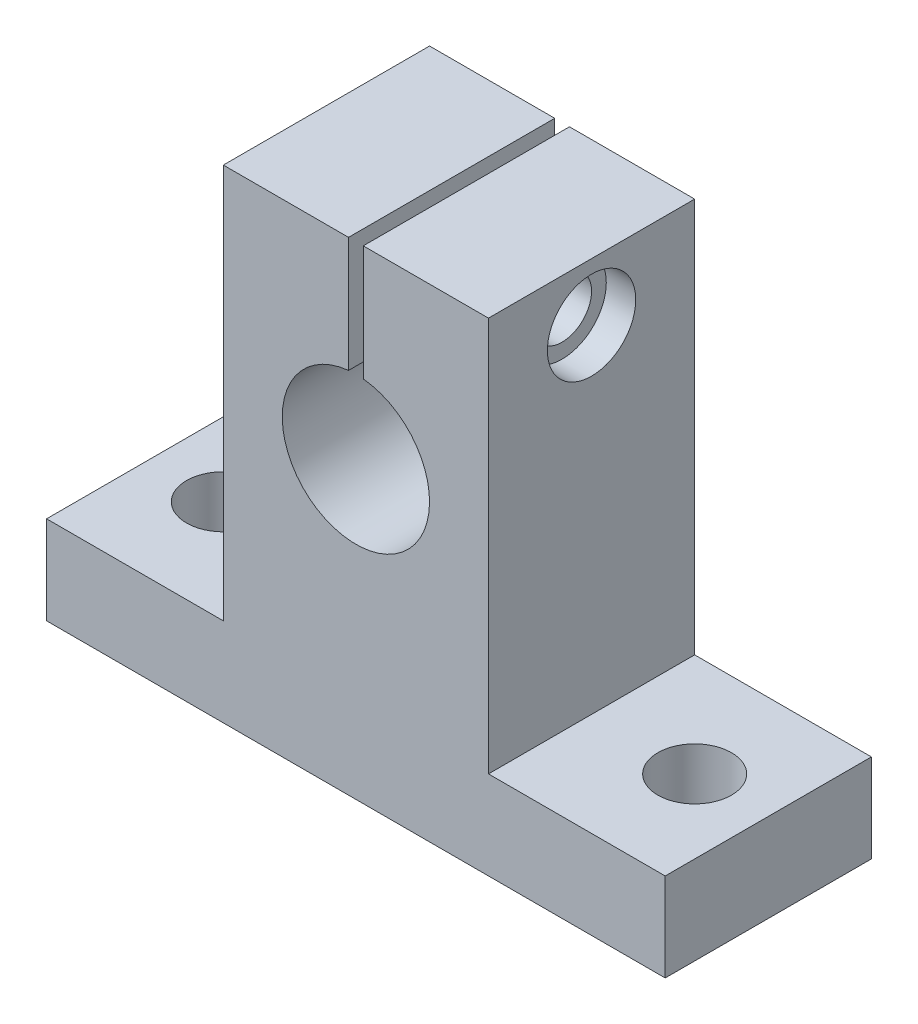
ISO-10303-21;
HEADER;
FILE_DESCRIPTION(('STEP AP214'),'2;1');
FILE_NAME('part.step','',(''),(''),'','','');
FILE_SCHEMA(('AUTOMOTIVE_DESIGN { 1 0 10303 214 1 1 1 1 }'));
ENDSEC;
DATA;
#1=APPLICATION_CONTEXT('core data for automotive mechanical design processes');
#2=APPLICATION_PROTOCOL_DEFINITION('international standard','automotive_design',2000,#1);
#3=PRODUCT_CONTEXT('',#1,'mechanical');
#4=PRODUCT('Part','Part','',(#3));
#5=PRODUCT_RELATED_PRODUCT_CATEGORY('part','',(#4));
#6=PRODUCT_DEFINITION_FORMATION('','',#4);
#7=PRODUCT_DEFINITION_CONTEXT('part definition',#1,'design');
#8=PRODUCT_DEFINITION('design','',#6,#7);
#9=PRODUCT_DEFINITION_SHAPE('','',#8);
#10=(LENGTH_UNIT() NAMED_UNIT(*) SI_UNIT(.MILLI.,.METRE.));
#11=(NAMED_UNIT(*) PLANE_ANGLE_UNIT() SI_UNIT($,.RADIAN.));
#12=(NAMED_UNIT(*) SI_UNIT($,.STERADIAN.) SOLID_ANGLE_UNIT());
#13=UNCERTAINTY_MEASURE_WITH_UNIT(LENGTH_MEASURE(1.E-05),#10,'distance_accuracy_value','');
#14=(GEOMETRIC_REPRESENTATION_CONTEXT(3) GLOBAL_UNCERTAINTY_ASSIGNED_CONTEXT((#13)) GLOBAL_UNIT_ASSIGNED_CONTEXT((#10,
#11,#12)) REPRESENTATION_CONTEXT('',''));
#15=CARTESIAN_POINT('',(0.,0.,0.));
#16=DIRECTION('',(0.,0.,1.));
#17=DIRECTION('',(1.,0.,0.));
#18=AXIS2_PLACEMENT_3D('',#15,#16,#17);
#19=CARTESIAN_POINT('',(-10.5,28.8874685927665,7.));
#20=DIRECTION('',(1.,0.,0.));
#21=DIRECTION('',(0.,0.,-1.));
#22=AXIS2_PLACEMENT_3D('',#19,#20,#21);
#23=CYLINDRICAL_SURFACE('',#22,2.);
#24=CARTESIAN_POINT('',(0.500000000000002,28.8874685927665,7.));
#25=DIRECTION('',(1.,0.,0.));
#26=DIRECTION('',(0.,0.,-1.));
#27=AXIS2_PLACEMENT_3D('',#24,#25,#26);
#28=CIRCLE('',#27,2.);
#29=CARTESIAN_POINT('',(0.500000000000002,28.8874685927665,5.));
#30=VERTEX_POINT('',#29);
#31=EDGE_CURVE('E203',#30,#30,#28,.T.);
#32=ORIENTED_EDGE('',*,*,#31,.F.);
#33=EDGE_LOOP('',(#32));
#34=FACE_BOUND('',#33,.T.);
#35=CARTESIAN_POINT('',(7.,28.8874685927665,7.));
#36=DIRECTION('',(1.,0.,0.));
#37=DIRECTION('',(0.,0.,-1.));
#38=AXIS2_PLACEMENT_3D('',#35,#36,#37);
#39=CIRCLE('',#38,2.);
#40=CARTESIAN_POINT('',(7.,28.8874685927665,5.));
#41=VERTEX_POINT('',#40);
#42=EDGE_CURVE('E39',#41,#41,#39,.F.);
#43=ORIENTED_EDGE('',*,*,#42,.F.);
#44=EDGE_LOOP('',(#43));
#45=FACE_BOUND('',#44,.T.);
#46=ADVANCED_FACE('F35',(#34,#45),#23,.F.);
#47=CARTESIAN_POINT('',(-9.,32.8,14.));
#48=DIRECTION('',(0.,-1.,0.));
#49=DIRECTION('',(0.,0.,-1.));
#50=AXIS2_PLACEMENT_3D('',#47,#48,#49);
#51=PLANE('',#50);
#52=DIRECTION('',(-1.,0.,0.));
#53=VECTOR('',#52,1.);
#54=CARTESIAN_POINT('',(-9.,32.8,14.));
#55=LINE('',#54,#53);
#56=CARTESIAN_POINT('',(-0.499999999999998,32.8,14.));
#57=VERTEX_POINT('',#56);
#58=CARTESIAN_POINT('',(-9.,32.8,14.));
#59=VERTEX_POINT('',#58);
#60=EDGE_CURVE('E136',#57,#59,#55,.T.);
#61=ORIENTED_EDGE('',*,*,#60,.F.);
#62=DIRECTION('',(0.,0.,1.));
#63=VECTOR('',#62,1.);
#64=CARTESIAN_POINT('',(-0.5,32.8,0.));
#65=LINE('',#64,#63);
#66=CARTESIAN_POINT('',(-0.5,32.8,0.));
#67=VERTEX_POINT('',#66);
#68=EDGE_CURVE('E123',#67,#57,#65,.T.);
#69=ORIENTED_EDGE('',*,*,#68,.F.);
#70=DIRECTION('',(-1.,0.,0.));
#71=VECTOR('',#70,1.);
#72=CARTESIAN_POINT('',(-9.,32.8,0.));
#73=LINE('',#72,#71);
#74=CARTESIAN_POINT('',(-9.,32.8,0.));
#75=VERTEX_POINT('',#74);
#76=EDGE_CURVE('E171',#67,#75,#73,.T.);
#77=ORIENTED_EDGE('',*,*,#76,.T.);
#78=DIRECTION('',(0.,0.,-1.));
#79=VECTOR('',#78,1.);
#80=CARTESIAN_POINT('',(-9.,32.8,14.));
#81=LINE('',#80,#79);
#82=EDGE_CURVE('E145',#59,#75,#81,.T.);
#83=ORIENTED_EDGE('',*,*,#82,.F.);
#84=EDGE_LOOP('',(#61,#69,#77,#83));
#85=FACE_BOUND('',#84,.T.);
#86=ADVANCED_FACE('F143',(#85),#51,.F.);
#87=CARTESIAN_POINT('',(0.,0.,14.));
#88=DIRECTION('',(0.,0.,-1.));
#89=DIRECTION('',(-1.,0.,0.));
#90=AXIS2_PLACEMENT_3D('',#87,#88,#89);
#91=PLANE('',#90);
#92=CARTESIAN_POINT('',(0.,20.,14.));
#93=DIRECTION('',(0.,0.,1.));
#94=DIRECTION('',(1.,0.,0.));
#95=AXIS2_PLACEMENT_3D('',#92,#93,#94);
#96=CIRCLE('',#95,5.);
#97=CARTESIAN_POINT('',(-0.499999999999998,24.9749371855331,14.));
#98=VERTEX_POINT('',#97);
#99=CARTESIAN_POINT('',(0.500000000000002,24.9749371855331,14.));
#100=VERTEX_POINT('',#99);
#101=EDGE_CURVE('E140',#98,#100,#96,.T.);
#102=ORIENTED_EDGE('',*,*,#101,.F.);
#103=DIRECTION('',(0.,1.,0.));
#104=VECTOR('',#103,1.);
#105=CARTESIAN_POINT('',(-0.499999999999998,18.8,14.));
#106=LINE('',#105,#104);
#107=EDGE_CURVE('E59',#98,#57,#106,.T.);
#108=ORIENTED_EDGE('',*,*,#107,.T.);
#109=ORIENTED_EDGE('',*,*,#60,.T.);
#110=DIRECTION('',(0.,-1.,0.));
#111=VECTOR('',#110,1.);
#112=CARTESIAN_POINT('',(-9.,6.,14.));
#113=LINE('',#112,#111);
#114=CARTESIAN_POINT('',(-9.,6.,14.));
#115=VERTEX_POINT('',#114);
#116=EDGE_CURVE('E151',#59,#115,#113,.T.);
#117=ORIENTED_EDGE('',*,*,#116,.T.);
#118=DIRECTION('',(-1.,0.,0.));
#119=VECTOR('',#118,1.);
#120=CARTESIAN_POINT('',(-21.,6.,14.));
#121=LINE('',#120,#119);
#122=CARTESIAN_POINT('',(-21.,6.,14.));
#123=VERTEX_POINT('',#122);
#124=EDGE_CURVE('E157',#115,#123,#121,.T.);
#125=ORIENTED_EDGE('',*,*,#124,.T.);
#126=DIRECTION('',(0.,-1.,0.));
#127=VECTOR('',#126,1.);
#128=CARTESIAN_POINT('',(-21.,0.,14.));
#129=LINE('',#128,#127);
#130=CARTESIAN_POINT('',(-21.,0.,14.));
#131=VERTEX_POINT('',#130);
#132=EDGE_CURVE('E179',#123,#131,#129,.T.);
#133=ORIENTED_EDGE('',*,*,#132,.T.);
#134=DIRECTION('',(1.,0.,0.));
#135=VECTOR('',#134,1.);
#136=CARTESIAN_POINT('',(21.,0.,14.));
#137=LINE('',#136,#135);
#138=CARTESIAN_POINT('',(21.,0.,14.));
#139=VERTEX_POINT('',#138);
#140=EDGE_CURVE('E244',#131,#139,#137,.T.);
#141=ORIENTED_EDGE('',*,*,#140,.T.);
#142=DIRECTION('',(0.,1.,0.));
#143=VECTOR('',#142,1.);
#144=CARTESIAN_POINT('',(21.,0.,14.));
#145=LINE('',#144,#143);
#146=CARTESIAN_POINT('',(21.,6.,14.));
#147=VERTEX_POINT('',#146);
#148=EDGE_CURVE('E246',#139,#147,#145,.T.);
#149=ORIENTED_EDGE('',*,*,#148,.T.);
#150=DIRECTION('',(-1.,0.,0.));
#151=VECTOR('',#150,1.);
#152=CARTESIAN_POINT('',(21.,6.,14.));
#153=LINE('',#152,#151);
#154=CARTESIAN_POINT('',(9.,6.,14.));
#155=VERTEX_POINT('',#154);
#156=EDGE_CURVE('E152',#147,#155,#153,.T.);
#157=ORIENTED_EDGE('',*,*,#156,.T.);
#158=DIRECTION('',(0.,1.,0.));
#159=VECTOR('',#158,1.);
#160=CARTESIAN_POINT('',(9.,6.,14.));
#161=LINE('',#160,#159);
#162=CARTESIAN_POINT('',(9.,32.8,14.));
#163=VERTEX_POINT('',#162);
#164=EDGE_CURVE('E148',#155,#163,#161,.T.);
#165=ORIENTED_EDGE('',*,*,#164,.T.);
#166=CARTESIAN_POINT('',(0.500000000000002,32.8,14.));
#167=VERTEX_POINT('',#166);
#168=EDGE_CURVE('E147',#163,#167,#55,.T.);
#169=ORIENTED_EDGE('',*,*,#168,.T.);
#170=DIRECTION('',(0.,1.,0.));
#171=VECTOR('',#170,1.);
#172=CARTESIAN_POINT('',(0.500000000000002,18.8,14.));
#173=LINE('',#172,#171);
#174=EDGE_CURVE('E141',#100,#167,#173,.T.);
#175=ORIENTED_EDGE('',*,*,#174,.F.);
#176=EDGE_LOOP('',(#102,#108,#109,#117,#125,#133,#141,#149,#157,#165,#169,#175));
#177=FACE_BOUND('',#176,.T.);
#178=ADVANCED_FACE('F135',(#177),#91,.F.);
#179=CARTESIAN_POINT('',(0.,0.,0.));
#180=DIRECTION('',(0.,0.,-1.));
#181=DIRECTION('',(-1.,0.,0.));
#182=AXIS2_PLACEMENT_3D('',#179,#180,#181);
#183=PLANE('',#182);
#184=DIRECTION('',(0.,1.,0.));
#185=VECTOR('',#184,1.);
#186=CARTESIAN_POINT('',(-0.5,18.8,0.));
#187=LINE('',#186,#185);
#188=CARTESIAN_POINT('',(-0.5,24.9749371855331,0.));
#189=VERTEX_POINT('',#188);
#190=EDGE_CURVE('E126',#189,#67,#187,.T.);
#191=ORIENTED_EDGE('',*,*,#190,.F.);
#192=CARTESIAN_POINT('',(0.,20.,0.));
#193=DIRECTION('',(0.,0.,1.));
#194=DIRECTION('',(1.,0.,0.));
#195=AXIS2_PLACEMENT_3D('',#192,#193,#194);
#196=CIRCLE('',#195,5.);
#197=CARTESIAN_POINT('',(0.500000000000002,24.9749371855331,0.));
#198=VERTEX_POINT('',#197);
#199=EDGE_CURVE('E236',#189,#198,#196,.T.);
#200=ORIENTED_EDGE('',*,*,#199,.T.);
#201=DIRECTION('',(0.,1.,0.));
#202=VECTOR('',#201,1.);
#203=CARTESIAN_POINT('',(0.5,18.8,0.));
#204=LINE('',#203,#202);
#205=CARTESIAN_POINT('',(0.5,32.8,0.));
#206=VERTEX_POINT('',#205);
#207=EDGE_CURVE('E52',#198,#206,#204,.T.);
#208=ORIENTED_EDGE('',*,*,#207,.T.);
#209=CARTESIAN_POINT('',(9.,32.8,0.));
#210=VERTEX_POINT('',#209);
#211=EDGE_CURVE('E172',#210,#206,#73,.T.);
#212=ORIENTED_EDGE('',*,*,#211,.F.);
#213=DIRECTION('',(0.,1.,0.));
#214=VECTOR('',#213,1.);
#215=CARTESIAN_POINT('',(9.,6.,0.));
#216=LINE('',#215,#214);
#217=CARTESIAN_POINT('',(9.,6.,0.));
#218=VERTEX_POINT('',#217);
#219=EDGE_CURVE('E169',#218,#210,#216,.T.);
#220=ORIENTED_EDGE('',*,*,#219,.F.);
#221=DIRECTION('',(-1.,0.,0.));
#222=VECTOR('',#221,1.);
#223=CARTESIAN_POINT('',(21.,6.,0.));
#224=LINE('',#223,#222);
#225=CARTESIAN_POINT('',(21.,6.,0.));
#226=VERTEX_POINT('',#225);
#227=EDGE_CURVE('E167',#226,#218,#224,.T.);
#228=ORIENTED_EDGE('',*,*,#227,.F.);
#229=DIRECTION('',(0.,1.,0.));
#230=VECTOR('',#229,1.);
#231=CARTESIAN_POINT('',(21.,0.,0.));
#232=LINE('',#231,#230);
#233=CARTESIAN_POINT('',(21.,0.,0.));
#234=VERTEX_POINT('',#233);
#235=EDGE_CURVE('E165',#234,#226,#232,.T.);
#236=ORIENTED_EDGE('',*,*,#235,.F.);
#237=DIRECTION('',(1.,0.,0.));
#238=VECTOR('',#237,1.);
#239=CARTESIAN_POINT('',(21.,0.,0.));
#240=LINE('',#239,#238);
#241=CARTESIAN_POINT('',(-21.,0.,0.));
#242=VERTEX_POINT('',#241);
#243=EDGE_CURVE('E163',#242,#234,#240,.T.);
#244=ORIENTED_EDGE('',*,*,#243,.F.);
#245=DIRECTION('',(0.,-1.,0.));
#246=VECTOR('',#245,1.);
#247=CARTESIAN_POINT('',(-21.,0.,0.));
#248=LINE('',#247,#246);
#249=CARTESIAN_POINT('',(-21.,6.,0.));
#250=VERTEX_POINT('',#249);
#251=EDGE_CURVE('E160',#250,#242,#248,.T.);
#252=ORIENTED_EDGE('',*,*,#251,.F.);
#253=DIRECTION('',(-1.,0.,0.));
#254=VECTOR('',#253,1.);
#255=CARTESIAN_POINT('',(-21.,6.,0.));
#256=LINE('',#255,#254);
#257=CARTESIAN_POINT('',(-9.,6.,0.));
#258=VERTEX_POINT('',#257);
#259=EDGE_CURVE('E177',#258,#250,#256,.T.);
#260=ORIENTED_EDGE('',*,*,#259,.F.);
#261=DIRECTION('',(0.,-1.,0.));
#262=VECTOR('',#261,1.);
#263=CARTESIAN_POINT('',(-9.,6.,0.));
#264=LINE('',#263,#262);
#265=EDGE_CURVE('E175',#75,#258,#264,.T.);
#266=ORIENTED_EDGE('',*,*,#265,.F.);
#267=ORIENTED_EDGE('',*,*,#76,.F.);
#268=EDGE_LOOP('',(#191,#200,#208,#212,#220,#228,#236,#244,#252,#260,#266,#267));
#269=FACE_BOUND('',#268,.T.);
#270=ADVANCED_FACE('F268',(#269),#183,.T.);
#271=CARTESIAN_POINT('',(-21.,0.,14.));
#272=DIRECTION('',(1.,0.,0.));
#273=DIRECTION('',(0.,1.,0.));
#274=AXIS2_PLACEMENT_3D('',#271,#272,#273);
#275=PLANE('',#274);
#276=ORIENTED_EDGE('',*,*,#251,.T.);
#277=DIRECTION('',(0.,0.,-1.));
#278=VECTOR('',#277,1.);
#279=CARTESIAN_POINT('',(-21.,0.,14.));
#280=LINE('',#279,#278);
#281=EDGE_CURVE('E198',#131,#242,#280,.T.);
#282=ORIENTED_EDGE('',*,*,#281,.F.);
#283=ORIENTED_EDGE('',*,*,#132,.F.);
#284=DIRECTION('',(0.,0.,-1.));
#285=VECTOR('',#284,1.);
#286=CARTESIAN_POINT('',(-21.,6.,14.));
#287=LINE('',#286,#285);
#288=EDGE_CURVE('E159',#123,#250,#287,.T.);
#289=ORIENTED_EDGE('',*,*,#288,.T.);
#290=EDGE_LOOP('',(#276,#282,#283,#289));
#291=FACE_BOUND('',#290,.T.);
#292=ADVANCED_FACE('F37',(#291),#275,.F.);
#293=CARTESIAN_POINT('',(21.,0.,14.));
#294=DIRECTION('',(0.,1.,0.));
#295=DIRECTION('',(0.,0.,1.));
#296=AXIS2_PLACEMENT_3D('',#293,#294,#295);
#297=PLANE('',#296);
#298=CARTESIAN_POINT('',(16.,0.,6.99999999999999));
#299=DIRECTION('',(0.,1.,0.));
#300=DIRECTION('',(1.,0.,0.));
#301=AXIS2_PLACEMENT_3D('',#298,#299,#300);
#302=CIRCLE('',#301,2.5);
#303=CARTESIAN_POINT('',(18.5,0.,6.99999999999999));
#304=VERTEX_POINT('',#303);
#305=EDGE_CURVE('E227',#304,#304,#302,.T.);
#306=ORIENTED_EDGE('',*,*,#305,.T.);
#307=EDGE_LOOP('',(#306));
#308=FACE_BOUND('',#307,.T.);
#309=CARTESIAN_POINT('',(-16.,0.,7.));
#310=DIRECTION('',(0.,1.,0.));
#311=DIRECTION('',(-1.,0.,0.));
#312=AXIS2_PLACEMENT_3D('',#309,#310,#311);
#313=CIRCLE('',#312,2.5);
#314=CARTESIAN_POINT('',(-18.5,0.,7.));
#315=VERTEX_POINT('',#314);
#316=EDGE_CURVE('E233',#315,#315,#313,.T.);
#317=ORIENTED_EDGE('',*,*,#316,.T.);
#318=EDGE_LOOP('',(#317));
#319=FACE_BOUND('',#318,.T.);
#320=ORIENTED_EDGE('',*,*,#243,.T.);
#321=DIRECTION('',(0.,0.,-1.));
#322=VECTOR('',#321,1.);
#323=CARTESIAN_POINT('',(21.,0.,14.));
#324=LINE('',#323,#322);
#325=EDGE_CURVE('E195',#139,#234,#324,.T.);
#326=ORIENTED_EDGE('',*,*,#325,.F.);
#327=ORIENTED_EDGE('',*,*,#140,.F.);
#328=ORIENTED_EDGE('',*,*,#281,.T.);
#329=EDGE_LOOP('',(#320,#326,#327,#328));
#330=FACE_BOUND('',#329,.T.);
#331=ADVANCED_FACE('F283',(#308,#319,#330),#297,.F.);
#332=CARTESIAN_POINT('',(21.,0.,14.));
#333=DIRECTION('',(-1.,0.,0.));
#334=DIRECTION('',(0.,-1.,0.));
#335=AXIS2_PLACEMENT_3D('',#332,#333,#334);
#336=PLANE('',#335);
#337=ORIENTED_EDGE('',*,*,#235,.T.);
#338=DIRECTION('',(0.,0.,-1.));
#339=VECTOR('',#338,1.);
#340=CARTESIAN_POINT('',(21.,6.,14.));
#341=LINE('',#340,#339);
#342=EDGE_CURVE('E192',#147,#226,#341,.T.);
#343=ORIENTED_EDGE('',*,*,#342,.F.);
#344=ORIENTED_EDGE('',*,*,#148,.F.);
#345=ORIENTED_EDGE('',*,*,#325,.T.);
#346=EDGE_LOOP('',(#337,#343,#344,#345));
#347=FACE_BOUND('',#346,.T.);
#348=ADVANCED_FACE('F287',(#347),#336,.F.);
#349=CARTESIAN_POINT('',(21.,6.,14.));
#350=DIRECTION('',(0.,-1.,0.));
#351=DIRECTION('',(1.,0.,0.));
#352=AXIS2_PLACEMENT_3D('',#349,#350,#351);
#353=PLANE('',#352);
#354=CARTESIAN_POINT('',(16.,6.,6.99999999999999));
#355=DIRECTION('',(0.,1.,0.));
#356=DIRECTION('',(1.,0.,0.));
#357=AXIS2_PLACEMENT_3D('',#354,#355,#356);
#358=CIRCLE('',#357,2.5);
#359=CARTESIAN_POINT('',(18.5,6.,6.99999999999999));
#360=VERTEX_POINT('',#359);
#361=EDGE_CURVE('E224',#360,#360,#358,.T.);
#362=ORIENTED_EDGE('',*,*,#361,.F.);
#363=EDGE_LOOP('',(#362));
#364=FACE_BOUND('',#363,.T.);
#365=ORIENTED_EDGE('',*,*,#227,.T.);
#366=DIRECTION('',(0.,0.,-1.));
#367=VECTOR('',#366,1.);
#368=CARTESIAN_POINT('',(9.,6.,14.));
#369=LINE('',#368,#367);
#370=EDGE_CURVE('E189',#155,#218,#369,.T.);
#371=ORIENTED_EDGE('',*,*,#370,.F.);
#372=ORIENTED_EDGE('',*,*,#156,.F.);
#373=ORIENTED_EDGE('',*,*,#342,.T.);
#374=EDGE_LOOP('',(#365,#371,#372,#373));
#375=FACE_BOUND('',#374,.T.);
#376=ADVANCED_FACE('F254',(#364,#375),#353,.F.);
#377=CARTESIAN_POINT('',(9.,6.,14.));
#378=DIRECTION('',(-1.,0.,0.));
#379=DIRECTION('',(0.,0.,1.));
#380=AXIS2_PLACEMENT_3D('',#377,#378,#379);
#381=PLANE('',#380);
#382=CARTESIAN_POINT('',(9.,28.8874685927665,7.));
#383=DIRECTION('',(1.,0.,0.));
#384=DIRECTION('',(0.,0.,-1.));
#385=AXIS2_PLACEMENT_3D('',#382,#383,#384);
#386=CIRCLE('',#385,3.);
#387=CARTESIAN_POINT('',(9.,28.8874685927665,4.));
#388=VERTEX_POINT('',#387);
#389=EDGE_CURVE('E213',#388,#388,#386,.T.);
#390=ORIENTED_EDGE('',*,*,#389,.F.);
#391=EDGE_LOOP('',(#390));
#392=FACE_BOUND('',#391,.T.);
#393=ORIENTED_EDGE('',*,*,#219,.T.);
#394=DIRECTION('',(0.,0.,-1.));
#395=VECTOR('',#394,1.);
#396=CARTESIAN_POINT('',(9.,32.8,14.));
#397=LINE('',#396,#395);
#398=EDGE_CURVE('E186',#163,#210,#397,.T.);
#399=ORIENTED_EDGE('',*,*,#398,.F.);
#400=ORIENTED_EDGE('',*,*,#164,.F.);
#401=ORIENTED_EDGE('',*,*,#370,.T.);
#402=EDGE_LOOP('',(#393,#399,#400,#401));
#403=FACE_BOUND('',#402,.T.);
#404=ADVANCED_FACE('F258',(#392,#403),#381,.F.);
#405=ORIENTED_EDGE('',*,*,#211,.T.);
#406=DIRECTION('',(0.,0.,-1.));
#407=VECTOR('',#406,1.);
#408=CARTESIAN_POINT('',(0.5,32.8,0.));
#409=LINE('',#408,#407);
#410=EDGE_CURVE('E130',#167,#206,#409,.T.);
#411=ORIENTED_EDGE('',*,*,#410,.F.);
#412=ORIENTED_EDGE('',*,*,#168,.F.);
#413=ORIENTED_EDGE('',*,*,#398,.T.);
#414=EDGE_LOOP('',(#405,#411,#412,#413));
#415=FACE_BOUND('',#414,.T.);
#416=ADVANCED_FACE('F263',(#415),#51,.F.);
#417=CARTESIAN_POINT('',(-9.,6.,14.));
#418=DIRECTION('',(1.,0.,0.));
#419=DIRECTION('',(0.,0.,-1.));
#420=AXIS2_PLACEMENT_3D('',#417,#418,#419);
#421=PLANE('',#420);
#422=CARTESIAN_POINT('',(-9.,28.8874685927665,7.));
#423=DIRECTION('',(1.,0.,0.));
#424=DIRECTION('',(0.,0.,-1.));
#425=AXIS2_PLACEMENT_3D('',#422,#423,#424);
#426=CIRCLE('',#425,2.);
#427=CARTESIAN_POINT('',(-9.,28.8874685927665,5.));
#428=VERTEX_POINT('',#427);
#429=EDGE_CURVE('E131',#428,#428,#426,.T.);
#430=ORIENTED_EDGE('',*,*,#429,.T.);
#431=EDGE_LOOP('',(#430));
#432=FACE_BOUND('',#431,.T.);
#433=ORIENTED_EDGE('',*,*,#265,.T.);
#434=DIRECTION('',(0.,0.,-1.));
#435=VECTOR('',#434,1.);
#436=CARTESIAN_POINT('',(-9.,6.,14.));
#437=LINE('',#436,#435);
#438=EDGE_CURVE('E182',#115,#258,#437,.T.);
#439=ORIENTED_EDGE('',*,*,#438,.F.);
#440=ORIENTED_EDGE('',*,*,#116,.F.);
#441=ORIENTED_EDGE('',*,*,#82,.T.);
#442=EDGE_LOOP('',(#433,#439,#440,#441));
#443=FACE_BOUND('',#442,.T.);
#444=ADVANCED_FACE('F272',(#432,#443),#421,.F.);
#445=CARTESIAN_POINT('',(-21.,6.,14.));
#446=DIRECTION('',(0.,-1.,0.));
#447=DIRECTION('',(1.,0.,0.));
#448=AXIS2_PLACEMENT_3D('',#445,#446,#447);
#449=PLANE('',#448);
#450=CARTESIAN_POINT('',(-16.,5.99999999999999,7.));
#451=DIRECTION('',(0.,1.,0.));
#452=DIRECTION('',(-1.,0.,0.));
#453=AXIS2_PLACEMENT_3D('',#450,#451,#452);
#454=CIRCLE('',#453,2.5);
#455=CARTESIAN_POINT('',(-18.5,5.99999999999999,7.));
#456=VERTEX_POINT('',#455);
#457=EDGE_CURVE('E230',#456,#456,#454,.T.);
#458=ORIENTED_EDGE('',*,*,#457,.F.);
#459=EDGE_LOOP('',(#458));
#460=FACE_BOUND('',#459,.T.);
#461=ORIENTED_EDGE('',*,*,#259,.T.);
#462=ORIENTED_EDGE('',*,*,#288,.F.);
#463=ORIENTED_EDGE('',*,*,#124,.F.);
#464=ORIENTED_EDGE('',*,*,#438,.T.);
#465=EDGE_LOOP('',(#461,#462,#463,#464));
#466=FACE_BOUND('',#465,.T.);
#467=ADVANCED_FACE('F279',(#460,#466),#449,.F.);
#468=CARTESIAN_POINT('',(0.,20.,14.));
#469=DIRECTION('',(0.,0.,-1.));
#470=DIRECTION('',(-1.,0.,0.));
#471=AXIS2_PLACEMENT_3D('',#468,#469,#470);
#472=CYLINDRICAL_SURFACE('',#471,5.);
#473=DIRECTION('',(0.,0.,-1.));
#474=VECTOR('',#473,1.);
#475=CARTESIAN_POINT('',(-0.499999999999998,24.9749371855331,14.));
#476=LINE('',#475,#474);
#477=EDGE_CURVE('E11',#98,#189,#476,.T.);
#478=ORIENTED_EDGE('',*,*,#477,.F.);
#479=ORIENTED_EDGE('',*,*,#101,.T.);
#480=DIRECTION('',(0.,0.,-1.));
#481=VECTOR('',#480,1.);
#482=CARTESIAN_POINT('',(0.500000000000002,24.9749371855331,14.));
#483=LINE('',#482,#481);
#484=EDGE_CURVE('E44',#198,#100,#483,.F.);
#485=ORIENTED_EDGE('',*,*,#484,.F.);
#486=ORIENTED_EDGE('',*,*,#199,.F.);
#487=EDGE_LOOP('',(#478,#479,#485,#486));
#488=FACE_BOUND('',#487,.T.);
#489=ADVANCED_FACE('F265',(#488),#472,.F.);
#490=CARTESIAN_POINT('',(-16.,0.,7.));
#491=DIRECTION('',(0.,1.,0.));
#492=DIRECTION('',(-1.,0.,0.));
#493=AXIS2_PLACEMENT_3D('',#490,#491,#492);
#494=CYLINDRICAL_SURFACE('',#493,2.5);
#495=ORIENTED_EDGE('',*,*,#316,.F.);
#496=EDGE_LOOP('',(#495));
#497=FACE_BOUND('',#496,.T.);
#498=ORIENTED_EDGE('',*,*,#457,.T.);
#499=EDGE_LOOP('',(#498));
#500=FACE_BOUND('',#499,.T.);
#501=ADVANCED_FACE('F392',(#497,#500),#494,.F.);
#502=CARTESIAN_POINT('',(16.,0.,6.99999999999999));
#503=DIRECTION('',(0.,1.,0.));
#504=DIRECTION('',(-1.,0.,0.));
#505=AXIS2_PLACEMENT_3D('',#502,#503,#504);
#506=CYLINDRICAL_SURFACE('',#505,2.5);
#507=ORIENTED_EDGE('',*,*,#305,.F.);
#508=EDGE_LOOP('',(#507));
#509=FACE_BOUND('',#508,.T.);
#510=ORIENTED_EDGE('',*,*,#361,.T.);
#511=EDGE_LOOP('',(#510));
#512=FACE_BOUND('',#511,.T.);
#513=ADVANCED_FACE('F375',(#509,#512),#506,.F.);
#514=CARTESIAN_POINT('',(0.5,18.8,0.));
#515=DIRECTION('',(1.,0.,0.));
#516=DIRECTION('',(0.,0.,-1.));
#517=AXIS2_PLACEMENT_3D('',#514,#515,#516);
#518=PLANE('',#517);
#519=ORIENTED_EDGE('',*,*,#31,.T.);
#520=EDGE_LOOP('',(#519));
#521=FACE_BOUND('',#520,.T.);
#522=ORIENTED_EDGE('',*,*,#484,.T.);
#523=ORIENTED_EDGE('',*,*,#174,.T.);
#524=ORIENTED_EDGE('',*,*,#410,.T.);
#525=ORIENTED_EDGE('',*,*,#207,.F.);
#526=EDGE_LOOP('',(#522,#523,#524,#525));
#527=FACE_BOUND('',#526,.T.);
#528=ADVANCED_FACE('F318',(#521,#527),#518,.F.);
#529=CARTESIAN_POINT('',(-0.5,18.8,0.));
#530=DIRECTION('',(-1.,0.,0.));
#531=DIRECTION('',(0.,0.,1.));
#532=AXIS2_PLACEMENT_3D('',#529,#530,#531);
#533=PLANE('',#532);
#534=CARTESIAN_POINT('',(-0.499999999999999,28.8874685927665,7.));
#535=DIRECTION('',(-1.,0.,0.));
#536=DIRECTION('',(0.,0.,1.));
#537=AXIS2_PLACEMENT_3D('',#534,#535,#536);
#538=CIRCLE('',#537,2.);
#539=CARTESIAN_POINT('',(-0.499999999999999,28.8874685927665,9.00000000000001));
#540=VERTEX_POINT('',#539);
#541=EDGE_CURVE('E201',#540,#540,#538,.T.);
#542=ORIENTED_EDGE('',*,*,#541,.T.);
#543=EDGE_LOOP('',(#542));
#544=FACE_BOUND('',#543,.T.);
#545=ORIENTED_EDGE('',*,*,#477,.T.);
#546=ORIENTED_EDGE('',*,*,#190,.T.);
#547=ORIENTED_EDGE('',*,*,#68,.T.);
#548=ORIENTED_EDGE('',*,*,#107,.F.);
#549=EDGE_LOOP('',(#545,#546,#547,#548));
#550=FACE_BOUND('',#549,.T.);
#551=ADVANCED_FACE('F124',(#544,#550),#533,.F.);
#552=ORIENTED_EDGE('',*,*,#541,.F.);
#553=EDGE_LOOP('',(#552));
#554=FACE_BOUND('',#553,.T.);
#555=ORIENTED_EDGE('',*,*,#429,.F.);
#556=EDGE_LOOP('',(#555));
#557=FACE_BOUND('',#556,.T.);
#558=ADVANCED_FACE('F300',(#554,#557),#23,.F.);
#559=CARTESIAN_POINT('',(7.,28.8874685927665,7.));
#560=DIRECTION('',(1.,0.,0.));
#561=DIRECTION('',(0.,0.,-1.));
#562=AXIS2_PLACEMENT_3D('',#559,#560,#561);
#563=PLANE('',#562);
#564=CARTESIAN_POINT('',(7.,28.8874685927665,7.));
#565=DIRECTION('',(1.,0.,0.));
#566=DIRECTION('',(0.,0.,-1.));
#567=AXIS2_PLACEMENT_3D('',#564,#565,#566);
#568=CIRCLE('',#567,3.);
#569=CARTESIAN_POINT('',(7.,28.8874685927665,4.));
#570=VERTEX_POINT('',#569);
#571=EDGE_CURVE('E209',#570,#570,#568,.T.);
#572=ORIENTED_EDGE('',*,*,#571,.T.);
#573=EDGE_LOOP('',(#572));
#574=FACE_BOUND('',#573,.T.);
#575=ORIENTED_EDGE('',*,*,#42,.T.);
#576=EDGE_LOOP('',(#575));
#577=FACE_BOUND('',#576,.T.);
#578=ADVANCED_FACE('F310',(#574,#577),#563,.T.);
#579=CARTESIAN_POINT('',(7.,28.8874685927665,7.));
#580=DIRECTION('',(1.,0.,0.));
#581=DIRECTION('',(0.,0.,-1.));
#582=AXIS2_PLACEMENT_3D('',#579,#580,#581);
#583=CYLINDRICAL_SURFACE('',#582,3.);
#584=ORIENTED_EDGE('',*,*,#571,.F.);
#585=EDGE_LOOP('',(#584));
#586=FACE_BOUND('',#585,.T.);
#587=ORIENTED_EDGE('',*,*,#389,.T.);
#588=EDGE_LOOP('',(#587));
#589=FACE_BOUND('',#588,.T.);
#590=ADVANCED_FACE('F316',(#586,#589),#583,.F.);
#591=CLOSED_SHELL('',(#46,#86,#178,#270,#292,#331,#348,#376,#404,#416,#444,#467,#489,#501,#513,
#528,#551,#558,#578,#590));
#592=MANIFOLD_SOLID_BREP('B2',#591);
#593=ADVANCED_BREP_SHAPE_REPRESENTATION('',(#18,#592),#14);
#594=SHAPE_DEFINITION_REPRESENTATION(#9,#593);
ENDSEC;
END-ISO-10303-21;
